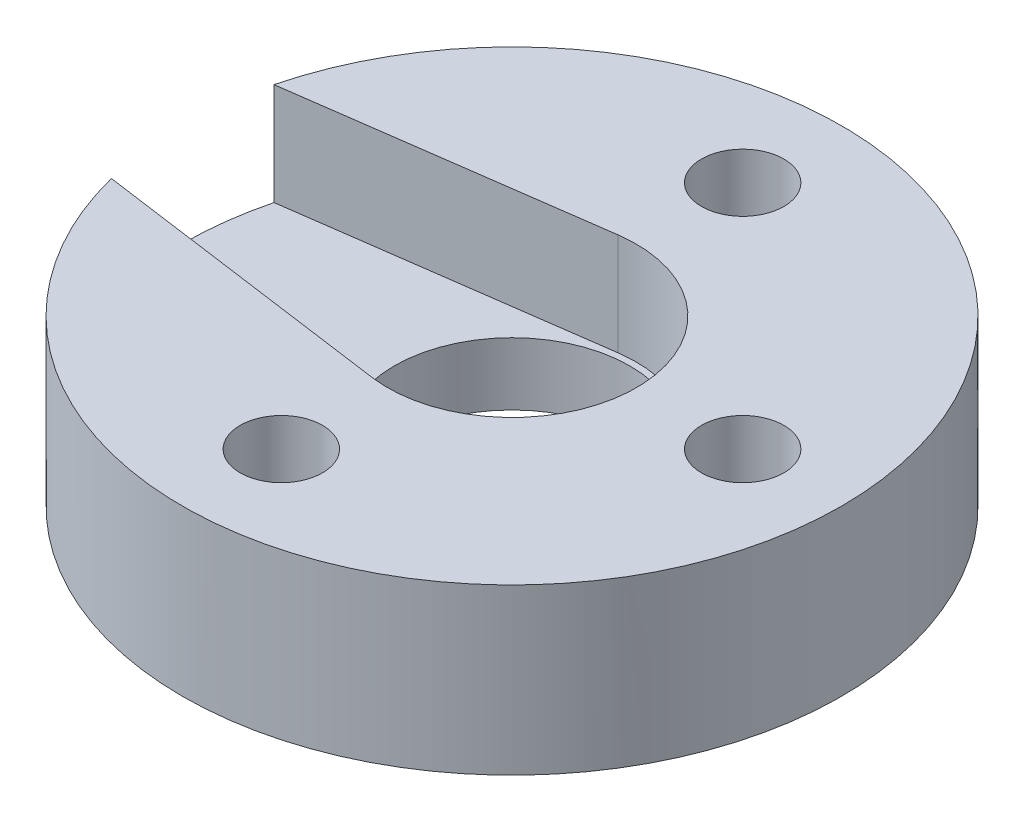
ISO-10303-21;
HEADER;
FILE_DESCRIPTION(('STEP AP214'),'2;1');
FILE_NAME('part.step','',(''),(''),'','','');
FILE_SCHEMA(('AUTOMOTIVE_DESIGN { 1 0 10303 214 1 1 1 1 }'));
ENDSEC;
DATA;
#1=APPLICATION_CONTEXT('core data for automotive mechanical design processes');
#2=APPLICATION_PROTOCOL_DEFINITION('international standard','automotive_design',2000,#1);
#3=PRODUCT_CONTEXT('',#1,'mechanical');
#4=PRODUCT('Part','Part','',(#3));
#5=PRODUCT_RELATED_PRODUCT_CATEGORY('part','',(#4));
#6=PRODUCT_DEFINITION_FORMATION('','',#4);
#7=PRODUCT_DEFINITION_CONTEXT('part definition',#1,'design');
#8=PRODUCT_DEFINITION('design','',#6,#7);
#9=PRODUCT_DEFINITION_SHAPE('','',#8);
#10=(LENGTH_UNIT() NAMED_UNIT(*) SI_UNIT(.MILLI.,.METRE.));
#11=(NAMED_UNIT(*) PLANE_ANGLE_UNIT() SI_UNIT($,.RADIAN.));
#12=(NAMED_UNIT(*) SI_UNIT($,.STERADIAN.) SOLID_ANGLE_UNIT());
#13=UNCERTAINTY_MEASURE_WITH_UNIT(LENGTH_MEASURE(1.E-05),#10,'distance_accuracy_value','');
#14=(GEOMETRIC_REPRESENTATION_CONTEXT(3) GLOBAL_UNCERTAINTY_ASSIGNED_CONTEXT((#13)) GLOBAL_UNIT_ASSIGNED_CONTEXT((#10,
#11,#12)) REPRESENTATION_CONTEXT('',''));
#15=CARTESIAN_POINT('',(0.,0.,0.));
#16=DIRECTION('',(0.,0.,1.));
#17=DIRECTION('',(1.,0.,0.));
#18=AXIS2_PLACEMENT_3D('',#15,#16,#17);
#19=CARTESIAN_POINT('',(0.,5.,0.));
#20=DIRECTION('',(0.,1.,0.));
#21=DIRECTION('',(0.,0.,1.));
#22=AXIS2_PLACEMENT_3D('',#19,#20,#21);
#23=CYLINDRICAL_SURFACE('',#22,3.57499919999999);
#24=CARTESIAN_POINT('',(0.,0.,0.));
#25=DIRECTION('',(0.,1.,0.));
#26=DIRECTION('',(0.,0.,1.));
#27=AXIS2_PLACEMENT_3D('',#24,#25,#26);
#28=CIRCLE('',#27,3.5749992);
#29=CARTESIAN_POINT('',(0.,0.,3.5749992));
#30=VERTEX_POINT('',#29);
#31=EDGE_CURVE('E120',#30,#30,#28,.T.);
#32=ORIENTED_EDGE('',*,*,#31,.F.);
#33=EDGE_LOOP('',(#32));
#34=FACE_BOUND('',#33,.T.);
#35=CARTESIAN_POINT('',(0.,1.9,0.));
#36=DIRECTION('',(0.,1.,0.));
#37=DIRECTION('',(0.,0.,1.));
#38=AXIS2_PLACEMENT_3D('',#35,#36,#37);
#39=CIRCLE('',#38,3.57499919999999);
#40=CARTESIAN_POINT('',(0.,1.9,3.57499919999999));
#41=VERTEX_POINT('',#40);
#42=EDGE_CURVE('E50',#41,#41,#39,.F.);
#43=ORIENTED_EDGE('',*,*,#42,.F.);
#44=EDGE_LOOP('',(#43));
#45=FACE_BOUND('',#44,.T.);
#46=ADVANCED_FACE('F46',(#34,#45),#23,.F.);
#47=CARTESIAN_POINT('',(0.,5.,0.));
#48=DIRECTION('',(0.,-1.,0.));
#49=DIRECTION('',(0.,0.,-1.));
#50=AXIS2_PLACEMENT_3D('',#47,#48,#49);
#51=CYLINDRICAL_SURFACE('',#50,10.);
#52=CARTESIAN_POINT('',(0.,5.,0.));
#53=DIRECTION('',(0.,1.,0.));
#54=DIRECTION('',(0.,0.,1.));
#55=AXIS2_PLACEMENT_3D('',#52,#53,#54);
#56=CIRCLE('',#55,10.);
#57=CARTESIAN_POINT('',(-9.69088943382744,5.,2.4671161264383));
#58=VERTEX_POINT('',#57);
#59=CARTESIAN_POINT('',(-9.69088943382744,5.,-2.4671161264383));
#60=VERTEX_POINT('',#59);
#61=EDGE_CURVE('E13',#58,#60,#56,.T.);
#62=ORIENTED_EDGE('',*,*,#61,.F.);
#63=DIRECTION('',(0.,-1.,0.));
#64=VECTOR('',#63,1.);
#65=CARTESIAN_POINT('',(-9.69088943382744,5.,2.4671161264383));
#66=LINE('',#65,#64);
#67=CARTESIAN_POINT('',(-9.69088943382744,1.9,2.4671161264383));
#68=VERTEX_POINT('',#67);
#69=EDGE_CURVE('E117',#58,#68,#66,.T.);
#70=ORIENTED_EDGE('',*,*,#69,.T.);
#71=CARTESIAN_POINT('',(0.,1.9,0.));
#72=DIRECTION('',(0.,1.,0.));
#73=DIRECTION('',(0.,0.,1.));
#74=AXIS2_PLACEMENT_3D('',#71,#72,#73);
#75=CIRCLE('',#74,10.);
#76=CARTESIAN_POINT('',(-9.69088943382744,1.9,-2.4671161264383));
#77=VERTEX_POINT('',#76);
#78=EDGE_CURVE('E114',#77,#68,#75,.T.);
#79=ORIENTED_EDGE('',*,*,#78,.F.);
#80=DIRECTION('',(0.,-1.,0.));
#81=VECTOR('',#80,1.);
#82=CARTESIAN_POINT('',(-9.69088943382744,5.,-2.4671161264383));
#83=LINE('',#82,#81);
#84=EDGE_CURVE('E71',#77,#60,#83,.F.);
#85=ORIENTED_EDGE('',*,*,#84,.T.);
#86=EDGE_LOOP('',(#62,#70,#79,#85));
#87=FACE_BOUND('',#86,.T.);
#88=CARTESIAN_POINT('',(0.,0.,0.));
#89=DIRECTION('',(0.,1.,0.));
#90=DIRECTION('',(0.,0.,1.));
#91=AXIS2_PLACEMENT_3D('',#88,#89,#90);
#92=CIRCLE('',#91,10.);
#93=CARTESIAN_POINT('',(0.,0.,10.));
#94=VERTEX_POINT('',#93);
#95=EDGE_CURVE('E55',#94,#94,#92,.T.);
#96=ORIENTED_EDGE('',*,*,#95,.T.);
#97=EDGE_LOOP('',(#96));
#98=FACE_BOUND('',#97,.T.);
#99=ADVANCED_FACE('F48',(#87,#98),#51,.T.);
#100=CARTESIAN_POINT('',(0.,5.,0.));
#101=DIRECTION('',(0.,1.,0.));
#102=DIRECTION('',(0.,0.,1.));
#103=AXIS2_PLACEMENT_3D('',#100,#101,#102);
#104=PLANE('',#103);
#105=DIRECTION('',(0.990519295133654,0.,0.137373672761299));
#106=VECTOR('',#105,1.);
#107=CARTESIAN_POINT('',(-0.518585504832816,5.,3.7392095471312));
#108=LINE('',#107,#106);
#109=CARTESIAN_POINT('',(-0.518585504832816,5.,3.7392095471312));
#110=VERTEX_POINT('',#109);
#111=EDGE_CURVE('E105',#58,#110,#108,.T.);
#112=ORIENTED_EDGE('',*,*,#111,.F.);
#113=ORIENTED_EDGE('',*,*,#61,.T.);
#114=DIRECTION('',(-0.990519295133654,0.,0.137373672761299));
#115=VECTOR('',#114,1.);
#116=CARTESIAN_POINT('',(-0.518585504832816,5.,-3.73920954713119));
#117=LINE('',#116,#115);
#118=CARTESIAN_POINT('',(-0.518585504832816,5.,-3.73920954713119));
#119=VERTEX_POINT('',#118);
#120=EDGE_CURVE('E107',#119,#60,#117,.T.);
#121=ORIENTED_EDGE('',*,*,#120,.F.);
#122=CARTESIAN_POINT('',(0.,5.,0.));
#123=DIRECTION('',(0.,1.,0.));
#124=DIRECTION('',(0.,0.,1.));
#125=AXIS2_PLACEMENT_3D('',#122,#123,#124);
#126=CIRCLE('',#125,3.77499920042108);
#127=EDGE_CURVE('E63',#110,#119,#126,.T.);
#128=ORIENTED_EDGE('',*,*,#127,.F.);
#129=EDGE_LOOP('',(#112,#113,#121,#128));
#130=FACE_BOUND('',#129,.T.);
#131=CARTESIAN_POINT('',(0.,5.,-7.));
#132=DIRECTION('',(0.,1.,0.));
#133=DIRECTION('',(0.,0.,1.));
#134=AXIS2_PLACEMENT_3D('',#131,#132,#133);
#135=CIRCLE('',#134,1.25);
#136=CARTESIAN_POINT('',(0.,5.,-5.75000000000001));
#137=VERTEX_POINT('',#136);
#138=EDGE_CURVE('E123',#137,#137,#135,.T.);
#139=ORIENTED_EDGE('',*,*,#138,.F.);
#140=EDGE_LOOP('',(#139));
#141=FACE_BOUND('',#140,.T.);
#142=CARTESIAN_POINT('',(0.,5.,7.00000000000001));
#143=DIRECTION('',(0.,1.,0.));
#144=DIRECTION('',(0.,0.,1.));
#145=AXIS2_PLACEMENT_3D('',#142,#143,#144);
#146=CIRCLE('',#145,1.25);
#147=CARTESIAN_POINT('',(0.,5.,8.25));
#148=VERTEX_POINT('',#147);
#149=EDGE_CURVE('E127',#148,#148,#146,.T.);
#150=ORIENTED_EDGE('',*,*,#149,.F.);
#151=EDGE_LOOP('',(#150));
#152=FACE_BOUND('',#151,.T.);
#153=CARTESIAN_POINT('',(6.99999999999999,5.,0.));
#154=DIRECTION('',(0.,1.,0.));
#155=DIRECTION('',(0.,0.,1.));
#156=AXIS2_PLACEMENT_3D('',#153,#154,#155);
#157=CIRCLE('',#156,1.25);
#158=CARTESIAN_POINT('',(6.99999999999999,5.,1.25));
#159=VERTEX_POINT('',#158);
#160=EDGE_CURVE('E133',#159,#159,#157,.T.);
#161=ORIENTED_EDGE('',*,*,#160,.F.);
#162=EDGE_LOOP('',(#161));
#163=FACE_BOUND('',#162,.T.);
#164=ADVANCED_FACE('F167',(#130,#141,#152,#163),#104,.T.);
#165=CARTESIAN_POINT('',(0.,0.,0.));
#166=DIRECTION('',(0.,1.,0.));
#167=DIRECTION('',(0.,0.,1.));
#168=AXIS2_PLACEMENT_3D('',#165,#166,#167);
#169=PLANE('',#168);
#170=ORIENTED_EDGE('',*,*,#31,.T.);
#171=EDGE_LOOP('',(#170));
#172=FACE_BOUND('',#171,.T.);
#173=CARTESIAN_POINT('',(0.,0.,-7.));
#174=DIRECTION('',(0.,1.,0.));
#175=DIRECTION('',(0.,0.,1.));
#176=AXIS2_PLACEMENT_3D('',#173,#174,#175);
#177=CIRCLE('',#176,1.24999999999999);
#178=CARTESIAN_POINT('',(0.,0.,-5.75000000000001));
#179=VERTEX_POINT('',#178);
#180=EDGE_CURVE('E126',#179,#179,#177,.T.);
#181=ORIENTED_EDGE('',*,*,#180,.T.);
#182=EDGE_LOOP('',(#181));
#183=FACE_BOUND('',#182,.T.);
#184=CARTESIAN_POINT('',(0.,0.,7.00000000000001));
#185=DIRECTION('',(0.,1.,0.));
#186=DIRECTION('',(0.,0.,1.));
#187=AXIS2_PLACEMENT_3D('',#184,#185,#186);
#188=CIRCLE('',#187,1.24999999999999);
#189=CARTESIAN_POINT('',(0.,0.,8.25));
#190=VERTEX_POINT('',#189);
#191=EDGE_CURVE('E130',#190,#190,#188,.T.);
#192=ORIENTED_EDGE('',*,*,#191,.T.);
#193=EDGE_LOOP('',(#192));
#194=FACE_BOUND('',#193,.T.);
#195=CARTESIAN_POINT('',(6.99999999999999,0.,0.));
#196=DIRECTION('',(0.,1.,0.));
#197=DIRECTION('',(0.,0.,1.));
#198=AXIS2_PLACEMENT_3D('',#195,#196,#197);
#199=CIRCLE('',#198,1.24999999999999);
#200=CARTESIAN_POINT('',(6.99999999999999,0.,1.25));
#201=VERTEX_POINT('',#200);
#202=EDGE_CURVE('E136',#201,#201,#199,.T.);
#203=ORIENTED_EDGE('',*,*,#202,.T.);
#204=EDGE_LOOP('',(#203));
#205=FACE_BOUND('',#204,.T.);
#206=ORIENTED_EDGE('',*,*,#95,.F.);
#207=EDGE_LOOP('',(#206));
#208=FACE_BOUND('',#207,.T.);
#209=ADVANCED_FACE('F143',(#172,#183,#194,#205,#208),#169,.F.);
#210=CARTESIAN_POINT('',(6.99999999999999,5.,0.));
#211=DIRECTION('',(0.,1.,0.));
#212=DIRECTION('',(0.,0.,1.));
#213=AXIS2_PLACEMENT_3D('',#210,#211,#212);
#214=CYLINDRICAL_SURFACE('',#213,1.24999999999999);
#215=ORIENTED_EDGE('',*,*,#160,.T.);
#216=EDGE_LOOP('',(#215));
#217=FACE_BOUND('',#216,.T.);
#218=ORIENTED_EDGE('',*,*,#202,.F.);
#219=EDGE_LOOP('',(#218));
#220=FACE_BOUND('',#219,.T.);
#221=ADVANCED_FACE('F158',(#217,#220),#214,.F.);
#222=CARTESIAN_POINT('',(0.,5.,7.00000000000001));
#223=DIRECTION('',(0.,1.,0.));
#224=DIRECTION('',(0.,0.,1.));
#225=AXIS2_PLACEMENT_3D('',#222,#223,#224);
#226=CYLINDRICAL_SURFACE('',#225,1.24999999999999);
#227=ORIENTED_EDGE('',*,*,#149,.T.);
#228=EDGE_LOOP('',(#227));
#229=FACE_BOUND('',#228,.T.);
#230=ORIENTED_EDGE('',*,*,#191,.F.);
#231=EDGE_LOOP('',(#230));
#232=FACE_BOUND('',#231,.T.);
#233=ADVANCED_FACE('F149',(#229,#232),#226,.F.);
#234=CARTESIAN_POINT('',(0.,5.,-7.));
#235=DIRECTION('',(0.,1.,0.));
#236=DIRECTION('',(0.,0.,1.));
#237=AXIS2_PLACEMENT_3D('',#234,#235,#236);
#238=CYLINDRICAL_SURFACE('',#237,1.24999999999999);
#239=ORIENTED_EDGE('',*,*,#138,.T.);
#240=EDGE_LOOP('',(#239));
#241=FACE_BOUND('',#240,.T.);
#242=ORIENTED_EDGE('',*,*,#180,.F.);
#243=EDGE_LOOP('',(#242));
#244=FACE_BOUND('',#243,.T.);
#245=ADVANCED_FACE('F146',(#241,#244),#238,.F.);
#246=CARTESIAN_POINT('',(-0.518585504832816,1.9,3.7392095471312));
#247=DIRECTION('',(-0.137373672761299,0.,0.990519295133654));
#248=DIRECTION('',(0.990519295133655,0.,0.137373672761299));
#249=AXIS2_PLACEMENT_3D('',#246,#247,#248);
#250=PLANE('',#249);
#251=ORIENTED_EDGE('',*,*,#111,.T.);
#252=DIRECTION('',(0.,1.,0.));
#253=VECTOR('',#252,1.);
#254=CARTESIAN_POINT('',(-0.518585504832816,1.9,3.7392095471312));
#255=LINE('',#254,#253);
#256=CARTESIAN_POINT('',(-0.518585504832816,1.9,3.7392095471312));
#257=VERTEX_POINT('',#256);
#258=EDGE_CURVE('E94',#257,#110,#255,.T.);
#259=ORIENTED_EDGE('',*,*,#258,.F.);
#260=DIRECTION('',(0.990519295133654,0.,0.137373672761299));
#261=VECTOR('',#260,1.);
#262=CARTESIAN_POINT('',(-0.518585504832816,1.9,3.7392095471312));
#263=LINE('',#262,#261);
#264=EDGE_CURVE('E95',#68,#257,#263,.T.);
#265=ORIENTED_EDGE('',*,*,#264,.F.);
#266=ORIENTED_EDGE('',*,*,#69,.F.);
#267=EDGE_LOOP('',(#251,#259,#265,#266));
#268=FACE_BOUND('',#267,.T.);
#269=ADVANCED_FACE('F148',(#268),#250,.F.);
#270=CARTESIAN_POINT('',(-0.518585504832816,1.9,-3.73920954713119));
#271=DIRECTION('',(-0.137373672761299,0.,-0.990519295133655));
#272=DIRECTION('',(-0.990519295133655,0.,0.137373672761299));
#273=AXIS2_PLACEMENT_3D('',#270,#271,#272);
#274=PLANE('',#273);
#275=DIRECTION('',(-0.990519295133654,0.,0.137373672761299));
#276=VECTOR('',#275,1.);
#277=CARTESIAN_POINT('',(-0.518585504832816,1.9,-3.73920954713119));
#278=LINE('',#277,#276);
#279=CARTESIAN_POINT('',(-0.518585504832816,1.9,-3.73920954713119));
#280=VERTEX_POINT('',#279);
#281=EDGE_CURVE('E97',#280,#77,#278,.T.);
#282=ORIENTED_EDGE('',*,*,#281,.F.);
#283=DIRECTION('',(0.,1.,0.));
#284=VECTOR('',#283,1.);
#285=CARTESIAN_POINT('',(-0.518585504832816,1.9,-3.73920954713119));
#286=LINE('',#285,#284);
#287=EDGE_CURVE('E89',#280,#119,#286,.T.);
#288=ORIENTED_EDGE('',*,*,#287,.T.);
#289=ORIENTED_EDGE('',*,*,#120,.T.);
#290=ORIENTED_EDGE('',*,*,#84,.F.);
#291=EDGE_LOOP('',(#282,#288,#289,#290));
#292=FACE_BOUND('',#291,.T.);
#293=ADVANCED_FACE('F98',(#292),#274,.F.);
#294=CARTESIAN_POINT('',(0.,1.9,0.));
#295=DIRECTION('',(0.,1.,0.));
#296=DIRECTION('',(0.,0.,1.));
#297=AXIS2_PLACEMENT_3D('',#294,#295,#296);
#298=PLANE('',#297);
#299=ORIENTED_EDGE('',*,*,#42,.T.);
#300=EDGE_LOOP('',(#299));
#301=FACE_BOUND('',#300,.T.);
#302=ORIENTED_EDGE('',*,*,#78,.T.);
#303=ORIENTED_EDGE('',*,*,#264,.T.);
#304=CARTESIAN_POINT('',(0.,1.9,0.));
#305=DIRECTION('',(0.,1.,0.));
#306=DIRECTION('',(0.,0.,1.));
#307=AXIS2_PLACEMENT_3D('',#304,#305,#306);
#308=CIRCLE('',#307,3.77499920042108);
#309=EDGE_CURVE('E92',#257,#280,#308,.T.);
#310=ORIENTED_EDGE('',*,*,#309,.T.);
#311=ORIENTED_EDGE('',*,*,#281,.T.);
#312=EDGE_LOOP('',(#302,#303,#310,#311));
#313=FACE_BOUND('',#312,.T.);
#314=ADVANCED_FACE('F102',(#301,#313),#298,.T.);
#315=CARTESIAN_POINT('',(0.,1.9,0.));
#316=DIRECTION('',(0.,1.,0.));
#317=DIRECTION('',(0.,0.,1.));
#318=AXIS2_PLACEMENT_3D('',#315,#316,#317);
#319=CYLINDRICAL_SURFACE('',#318,3.77499920042108);
#320=ORIENTED_EDGE('',*,*,#127,.T.);
#321=ORIENTED_EDGE('',*,*,#287,.F.);
#322=ORIENTED_EDGE('',*,*,#309,.F.);
#323=ORIENTED_EDGE('',*,*,#258,.T.);
#324=EDGE_LOOP('',(#320,#321,#322,#323));
#325=FACE_BOUND('',#324,.T.);
#326=ADVANCED_FACE('F90',(#325),#319,.F.);
#327=CLOSED_SHELL('',(#46,#99,#164,#209,#221,#233,#245,#269,#293,#314,#326));
#328=MANIFOLD_SOLID_BREP('B2',#327);
#329=ADVANCED_BREP_SHAPE_REPRESENTATION('',(#18,#328),#14);
#330=SHAPE_DEFINITION_REPRESENTATION(#9,#329);
ENDSEC;
END-ISO-10303-21;
